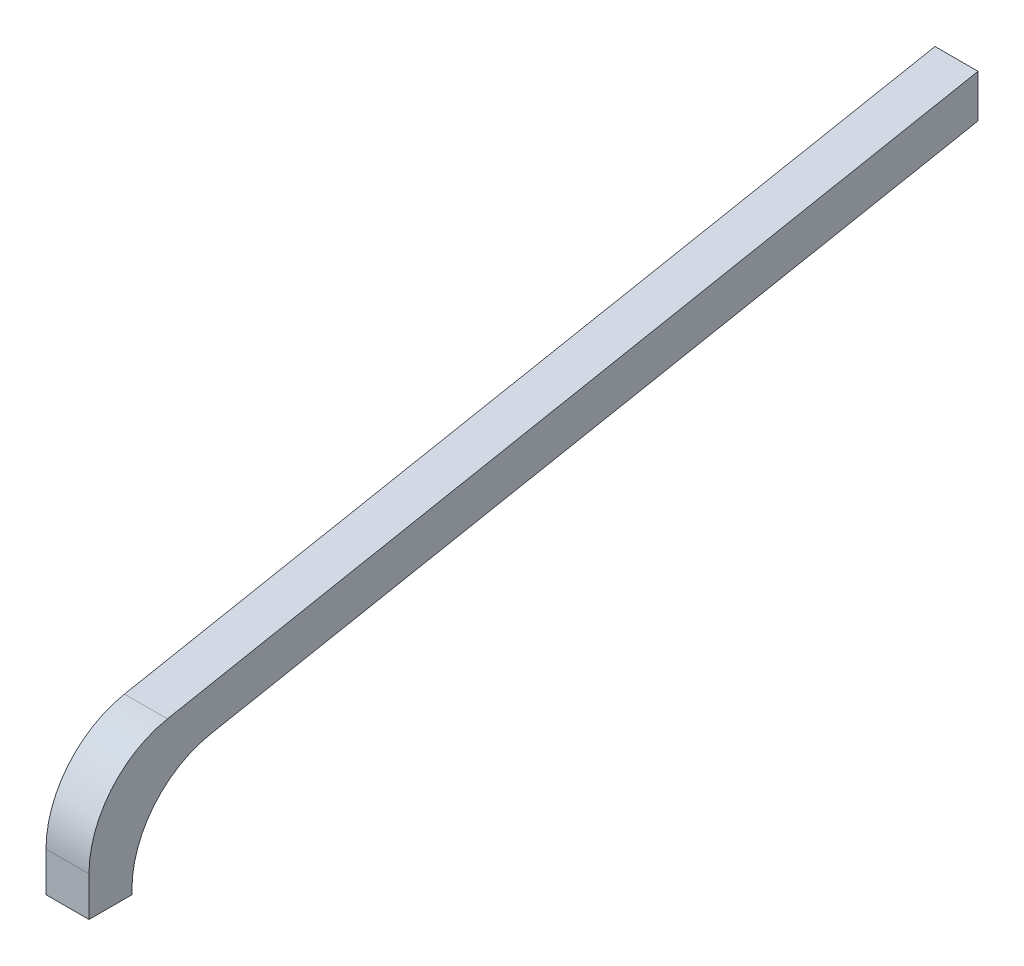
ISO-10303-21;
HEADER;
FILE_DESCRIPTION(('STEP AP214'),'2;1');
FILE_NAME('part.step','',(''),(''),'','','');
FILE_SCHEMA(('AUTOMOTIVE_DESIGN { 1 0 10303 214 1 1 1 1 }'));
ENDSEC;
DATA;
#1=APPLICATION_CONTEXT('core data for automotive mechanical design processes');
#2=APPLICATION_PROTOCOL_DEFINITION('international standard','automotive_design',2000,#1);
#3=PRODUCT_CONTEXT('',#1,'mechanical');
#4=PRODUCT('Part','Part','',(#3));
#5=PRODUCT_RELATED_PRODUCT_CATEGORY('part','',(#4));
#6=PRODUCT_DEFINITION_FORMATION('','',#4);
#7=PRODUCT_DEFINITION_CONTEXT('part definition',#1,'design');
#8=PRODUCT_DEFINITION('design','',#6,#7);
#9=PRODUCT_DEFINITION_SHAPE('','',#8);
#10=(LENGTH_UNIT() NAMED_UNIT(*) SI_UNIT(.MILLI.,.METRE.));
#11=(NAMED_UNIT(*) PLANE_ANGLE_UNIT() SI_UNIT($,.RADIAN.));
#12=(NAMED_UNIT(*) SI_UNIT($,.STERADIAN.) SOLID_ANGLE_UNIT());
#13=UNCERTAINTY_MEASURE_WITH_UNIT(LENGTH_MEASURE(1.E-05),#10,'distance_accuracy_value','');
#14=(GEOMETRIC_REPRESENTATION_CONTEXT(3) GLOBAL_UNCERTAINTY_ASSIGNED_CONTEXT((#13)) GLOBAL_UNIT_ASSIGNED_CONTEXT((#10,
#11,#12)) REPRESENTATION_CONTEXT('',''));
#15=CARTESIAN_POINT('',(0.,0.,0.));
#16=DIRECTION('',(0.,0.,1.));
#17=DIRECTION('',(1.,0.,0.));
#18=AXIS2_PLACEMENT_3D('',#15,#16,#17);
#19=CARTESIAN_POINT('',(-3.77825,-3.01580115473571,-2.8055));
#20=DIRECTION('',(1.,0.,0.));
#21=DIRECTION('',(0.,0.,-1.));
#22=AXIS2_PLACEMENT_3D('',#19,#20,#21);
#23=PLANE('',#22);
#24=DIRECTION('',(0.,-0.18846469104419,0.982079966311104));
#25=VECTOR('',#24,1.);
#26=CARTESIAN_POINT('',(-3.77825,-2.3929200336889,-3.06153530895581));
#27=LINE('',#26,#25);
#28=CARTESIAN_POINT('',(-3.77825,-0.869500000000001,-11.));
#29=VERTEX_POINT('',#28);
#30=CARTESIAN_POINT('',(-3.77825,-2.3929200336889,-3.06153530895581));
#31=VERTEX_POINT('',#30);
#32=EDGE_CURVE('E96',#29,#31,#27,.T.);
#33=ORIENTED_EDGE('',*,*,#32,.T.);
#34=CARTESIAN_POINT('',(-3.77825,-3.375,-3.25));
#35=DIRECTION('',(-1.,0.,0.));
#36=DIRECTION('',(0.,0.,1.));
#37=AXIS2_PLACEMENT_3D('',#34,#35,#36);
#38=CIRCLE('',#37,1.);
#39=CARTESIAN_POINT('',(-3.77825,-3.375,-2.25));
#40=VERTEX_POINT('',#39);
#41=EDGE_CURVE('E119',#31,#40,#38,.F.);
#42=ORIENTED_EDGE('',*,*,#41,.T.);
#43=DIRECTION('',(0.,1.,0.));
#44=VECTOR('',#43,1.);
#45=CARTESIAN_POINT('',(-3.77825,-3.425,-2.25));
#46=LINE('',#45,#44);
#47=CARTESIAN_POINT('',(-3.77825,-3.425,-2.25));
#48=VERTEX_POINT('',#47);
#49=EDGE_CURVE('E124',#40,#48,#46,.F.);
#50=ORIENTED_EDGE('',*,*,#49,.T.);
#51=DIRECTION('',(0.,0.,1.));
#52=VECTOR('',#51,1.);
#53=CARTESIAN_POINT('',(-3.77825,-3.425,-1.8055));
#54=LINE('',#53,#52);
#55=CARTESIAN_POINT('',(-3.77825,-3.425,-1.8055));
#56=VERTEX_POINT('',#55);
#57=EDGE_CURVE('E133',#48,#56,#54,.T.);
#58=ORIENTED_EDGE('',*,*,#57,.T.);
#59=DIRECTION('',(0.,1.,0.));
#60=VECTOR('',#59,1.);
#61=CARTESIAN_POINT('',(-3.77825,-3.01580115473571,-1.8055));
#62=LINE('',#61,#60);
#63=CARTESIAN_POINT('',(-3.77825,-3.01580115473571,-1.8055));
#64=VERTEX_POINT('',#63);
#65=EDGE_CURVE('E141',#56,#64,#62,.T.);
#66=ORIENTED_EDGE('',*,*,#65,.T.);
#67=CARTESIAN_POINT('',(-3.77825,-3.01580115473571,-2.8055));
#68=DIRECTION('',(-1.,0.,0.));
#69=DIRECTION('',(0.,0.,1.));
#70=AXIS2_PLACEMENT_3D('',#67,#68,#69);
#71=CIRCLE('',#70,1.);
#72=CARTESIAN_POINT('',(-3.77825,-2.03372118842461,-2.61703530895581));
#73=VERTEX_POINT('',#72);
#74=EDGE_CURVE('E20',#73,#64,#71,.F.);
#75=ORIENTED_EDGE('',*,*,#74,.F.);
#76=DIRECTION('',(0.,0.18846469104419,-0.982079966311104));
#77=VECTOR('',#76,1.);
#78=CARTESIAN_POINT('',(-3.77825,-0.425000000000001,-11.));
#79=LINE('',#78,#77);
#80=CARTESIAN_POINT('',(-3.77825,-0.425000000000001,-11.));
#81=VERTEX_POINT('',#80);
#82=EDGE_CURVE('E150',#73,#81,#79,.T.);
#83=ORIENTED_EDGE('',*,*,#82,.T.);
#84=DIRECTION('',(0.,1.,0.));
#85=VECTOR('',#84,1.);
#86=CARTESIAN_POINT('',(-3.77825,-0.869500000000001,-11.));
#87=LINE('',#86,#85);
#88=EDGE_CURVE('E70',#81,#29,#87,.F.);
#89=ORIENTED_EDGE('',*,*,#88,.T.);
#90=EDGE_LOOP('',(#33,#42,#50,#58,#66,#75,#83,#89));
#91=FACE_BOUND('',#90,.T.);
#92=ADVANCED_FACE('F17',(#91),#23,.F.);
#93=CARTESIAN_POINT('',(-3.33375,-0.869500000000001,-11.));
#94=DIRECTION('',(0.,0.,1.));
#95=DIRECTION('',(1.,0.,0.));
#96=AXIS2_PLACEMENT_3D('',#93,#94,#95);
#97=PLANE('',#96);
#98=DIRECTION('',(1.,0.,0.));
#99=VECTOR('',#98,1.);
#100=CARTESIAN_POINT('',(-3.33375,-0.425000000000001,-11.));
#101=LINE('',#100,#99);
#102=CARTESIAN_POINT('',(-3.33375,-0.425000000000001,-11.));
#103=VERTEX_POINT('',#102);
#104=EDGE_CURVE('E91',#81,#103,#101,.T.);
#105=ORIENTED_EDGE('',*,*,#104,.T.);
#106=DIRECTION('',(0.,1.,0.));
#107=VECTOR('',#106,1.);
#108=CARTESIAN_POINT('',(-3.33375,-3.01580115473571,-11.));
#109=LINE('',#108,#107);
#110=CARTESIAN_POINT('',(-3.33375,-0.869500000000001,-11.));
#111=VERTEX_POINT('',#110);
#112=EDGE_CURVE('E85',#111,#103,#109,.T.);
#113=ORIENTED_EDGE('',*,*,#112,.F.);
#114=DIRECTION('',(1.,0.,0.));
#115=VECTOR('',#114,1.);
#116=CARTESIAN_POINT('',(-3.33375,-0.869500000000001,-11.));
#117=LINE('',#116,#115);
#118=EDGE_CURVE('E88',#111,#29,#117,.F.);
#119=ORIENTED_EDGE('',*,*,#118,.T.);
#120=ORIENTED_EDGE('',*,*,#88,.F.);
#121=EDGE_LOOP('',(#105,#113,#119,#120));
#122=FACE_BOUND('',#121,.T.);
#123=ADVANCED_FACE('F87',(#122),#97,.F.);
#124=CARTESIAN_POINT('',(-3.33375,-0.425000000000001,-11.));
#125=DIRECTION('',(0.,-0.982079966311104,-0.18846469104419));
#126=DIRECTION('',(0.,0.18846469104419,-0.982079966311104));
#127=AXIS2_PLACEMENT_3D('',#124,#125,#126);
#128=PLANE('',#127);
#129=DIRECTION('',(-1.,0.,0.));
#130=VECTOR('',#129,1.);
#131=CARTESIAN_POINT('',(-3.33375,-2.03372118842461,-2.61703530895581));
#132=LINE('',#131,#130);
#133=CARTESIAN_POINT('',(-3.33375,-2.03372118842461,-2.61703530895581));
#134=VERTEX_POINT('',#133);
#135=EDGE_CURVE('E146',#134,#73,#132,.T.);
#136=ORIENTED_EDGE('',*,*,#135,.F.);
#137=DIRECTION('',(0.,-0.18846469104419,0.982079966311103));
#138=VECTOR('',#137,1.);
#139=CARTESIAN_POINT('',(-3.33375,-0.425000000000001,-11.));
#140=LINE('',#139,#138);
#141=EDGE_CURVE('E95',#103,#134,#140,.T.);
#142=ORIENTED_EDGE('',*,*,#141,.F.);
#143=ORIENTED_EDGE('',*,*,#104,.F.);
#144=ORIENTED_EDGE('',*,*,#82,.F.);
#145=EDGE_LOOP('',(#136,#142,#143,#144));
#146=FACE_BOUND('',#145,.T.);
#147=ADVANCED_FACE('F190',(#146),#128,.F.);
#148=CARTESIAN_POINT('',(-3.33375,-3.01580115473571,-2.8055));
#149=DIRECTION('',(-1.,0.,0.));
#150=DIRECTION('',(0.,0.,1.));
#151=AXIS2_PLACEMENT_3D('',#148,#149,#150);
#152=CYLINDRICAL_SURFACE('',#151,1.);
#153=CARTESIAN_POINT('',(-3.33375,-3.01580115473571,-2.8055));
#154=DIRECTION('',(-1.,0.,0.));
#155=DIRECTION('',(0.,0.,1.));
#156=AXIS2_PLACEMENT_3D('',#153,#154,#155);
#157=CIRCLE('',#156,1.);
#158=CARTESIAN_POINT('',(-3.33375,-3.01580115473571,-1.8055));
#159=VERTEX_POINT('',#158);
#160=EDGE_CURVE('E116',#134,#159,#157,.F.);
#161=ORIENTED_EDGE('',*,*,#160,.F.);
#162=ORIENTED_EDGE('',*,*,#135,.T.);
#163=ORIENTED_EDGE('',*,*,#74,.T.);
#164=DIRECTION('',(-1.,0.,0.));
#165=VECTOR('',#164,1.);
#166=CARTESIAN_POINT('',(-3.33375,-3.01580115473571,-1.8055));
#167=LINE('',#166,#165);
#168=EDGE_CURVE('E144',#64,#159,#167,.F.);
#169=ORIENTED_EDGE('',*,*,#168,.T.);
#170=EDGE_LOOP('',(#161,#162,#163,#169));
#171=FACE_BOUND('',#170,.T.);
#172=ADVANCED_FACE('F169',(#171),#152,.T.);
#173=CARTESIAN_POINT('',(-3.33375,-3.01580115473571,-1.8055));
#174=DIRECTION('',(0.,0.,-1.));
#175=DIRECTION('',(-1.,0.,0.));
#176=AXIS2_PLACEMENT_3D('',#173,#174,#175);
#177=PLANE('',#176);
#178=DIRECTION('',(1.,0.,0.));
#179=VECTOR('',#178,1.);
#180=CARTESIAN_POINT('',(-3.33375,-3.425,-1.8055));
#181=LINE('',#180,#179);
#182=CARTESIAN_POINT('',(-3.33375,-3.425,-1.8055));
#183=VERTEX_POINT('',#182);
#184=EDGE_CURVE('E139',#56,#183,#181,.T.);
#185=ORIENTED_EDGE('',*,*,#184,.T.);
#186=DIRECTION('',(0.,1.,0.));
#187=VECTOR('',#186,1.);
#188=CARTESIAN_POINT('',(-3.33375,-3.01580115473571,-1.8055));
#189=LINE('',#188,#187);
#190=EDGE_CURVE('E118',#159,#183,#189,.F.);
#191=ORIENTED_EDGE('',*,*,#190,.F.);
#192=ORIENTED_EDGE('',*,*,#168,.F.);
#193=ORIENTED_EDGE('',*,*,#65,.F.);
#194=EDGE_LOOP('',(#185,#191,#192,#193));
#195=FACE_BOUND('',#194,.T.);
#196=ADVANCED_FACE('F174',(#195),#177,.F.);
#197=CARTESIAN_POINT('',(-3.33375,-3.425,-1.8055));
#198=DIRECTION('',(0.,1.,0.));
#199=DIRECTION('',(0.,0.,1.));
#200=AXIS2_PLACEMENT_3D('',#197,#198,#199);
#201=PLANE('',#200);
#202=DIRECTION('',(1.,0.,0.));
#203=VECTOR('',#202,1.);
#204=CARTESIAN_POINT('',(-3.33375,-3.425,-2.25));
#205=LINE('',#204,#203);
#206=CARTESIAN_POINT('',(-3.33375,-3.425,-2.25));
#207=VERTEX_POINT('',#206);
#208=EDGE_CURVE('E127',#48,#207,#205,.T.);
#209=ORIENTED_EDGE('',*,*,#208,.T.);
#210=DIRECTION('',(0.,0.,-1.));
#211=VECTOR('',#210,1.);
#212=CARTESIAN_POINT('',(-3.33375,-3.425,-2.8055));
#213=LINE('',#212,#211);
#214=EDGE_CURVE('E110',#183,#207,#213,.T.);
#215=ORIENTED_EDGE('',*,*,#214,.F.);
#216=ORIENTED_EDGE('',*,*,#184,.F.);
#217=ORIENTED_EDGE('',*,*,#57,.F.);
#218=EDGE_LOOP('',(#209,#215,#216,#217));
#219=FACE_BOUND('',#218,.T.);
#220=ADVANCED_FACE('F212',(#219),#201,.F.);
#221=CARTESIAN_POINT('',(-3.33375,-3.425,-2.25));
#222=DIRECTION('',(0.,0.,1.));
#223=DIRECTION('',(1.,0.,0.));
#224=AXIS2_PLACEMENT_3D('',#221,#222,#223);
#225=PLANE('',#224);
#226=DIRECTION('',(-1.,0.,0.));
#227=VECTOR('',#226,1.);
#228=CARTESIAN_POINT('',(-3.33375,-3.375,-2.25));
#229=LINE('',#228,#227);
#230=CARTESIAN_POINT('',(-3.33375,-3.375,-2.25));
#231=VERTEX_POINT('',#230);
#232=EDGE_CURVE('E121',#40,#231,#229,.F.);
#233=ORIENTED_EDGE('',*,*,#232,.T.);
#234=DIRECTION('',(0.,1.,0.));
#235=VECTOR('',#234,1.);
#236=CARTESIAN_POINT('',(-3.33375,-3.01580115473571,-2.25));
#237=LINE('',#236,#235);
#238=EDGE_CURVE('E107',#207,#231,#237,.T.);
#239=ORIENTED_EDGE('',*,*,#238,.F.);
#240=ORIENTED_EDGE('',*,*,#208,.F.);
#241=ORIENTED_EDGE('',*,*,#49,.F.);
#242=EDGE_LOOP('',(#233,#239,#240,#241));
#243=FACE_BOUND('',#242,.T.);
#244=ADVANCED_FACE('F209',(#243),#225,.F.);
#245=CARTESIAN_POINT('',(-3.33375,-3.375,-3.25));
#246=DIRECTION('',(-1.,0.,0.));
#247=DIRECTION('',(0.,0.,1.));
#248=AXIS2_PLACEMENT_3D('',#245,#246,#247);
#249=CYLINDRICAL_SURFACE('',#248,1.);
#250=DIRECTION('',(1.,0.,0.));
#251=VECTOR('',#250,1.);
#252=CARTESIAN_POINT('',(-3.33375,-2.3929200336889,-3.06153530895581));
#253=LINE('',#252,#251);
#254=CARTESIAN_POINT('',(-3.33375,-2.3929200336889,-3.06153530895581));
#255=VERTEX_POINT('',#254);
#256=EDGE_CURVE('E35',#31,#255,#253,.T.);
#257=ORIENTED_EDGE('',*,*,#256,.T.);
#258=CARTESIAN_POINT('',(-3.33375,-3.375,-3.25));
#259=DIRECTION('',(-1.,0.,0.));
#260=DIRECTION('',(0.,0.,1.));
#261=AXIS2_PLACEMENT_3D('',#258,#259,#260);
#262=CIRCLE('',#261,1.);
#263=EDGE_CURVE('E26',#231,#255,#262,.T.);
#264=ORIENTED_EDGE('',*,*,#263,.F.);
#265=ORIENTED_EDGE('',*,*,#232,.F.);
#266=ORIENTED_EDGE('',*,*,#41,.F.);
#267=EDGE_LOOP('',(#257,#264,#265,#266));
#268=FACE_BOUND('',#267,.T.);
#269=ADVANCED_FACE('F204',(#268),#249,.F.);
#270=CARTESIAN_POINT('',(-3.33375,-2.3929200336889,-3.06153530895581));
#271=DIRECTION('',(0.,0.982079966311104,0.18846469104419));
#272=DIRECTION('',(0.,-0.18846469104419,0.982079966311104));
#273=AXIS2_PLACEMENT_3D('',#270,#271,#272);
#274=PLANE('',#273);
#275=ORIENTED_EDGE('',*,*,#118,.F.);
#276=DIRECTION('',(0.,0.18846469104419,-0.982079966311103));
#277=VECTOR('',#276,1.);
#278=CARTESIAN_POINT('',(-3.33375,-2.3929200336889,-3.06153530895581));
#279=LINE('',#278,#277);
#280=EDGE_CURVE('E11',#255,#111,#279,.T.);
#281=ORIENTED_EDGE('',*,*,#280,.F.);
#282=ORIENTED_EDGE('',*,*,#256,.F.);
#283=ORIENTED_EDGE('',*,*,#32,.F.);
#284=EDGE_LOOP('',(#275,#281,#282,#283));
#285=FACE_BOUND('',#284,.T.);
#286=ADVANCED_FACE('F99',(#285),#274,.F.);
#287=CARTESIAN_POINT('',(-3.33375,-3.01580115473571,-2.8055));
#288=DIRECTION('',(1.,0.,0.));
#289=DIRECTION('',(0.,0.,-1.));
#290=AXIS2_PLACEMENT_3D('',#287,#288,#289);
#291=PLANE('',#290);
#292=ORIENTED_EDGE('',*,*,#263,.T.);
#293=ORIENTED_EDGE('',*,*,#280,.T.);
#294=ORIENTED_EDGE('',*,*,#112,.T.);
#295=ORIENTED_EDGE('',*,*,#141,.T.);
#296=ORIENTED_EDGE('',*,*,#160,.T.);
#297=ORIENTED_EDGE('',*,*,#190,.T.);
#298=ORIENTED_EDGE('',*,*,#214,.T.);
#299=ORIENTED_EDGE('',*,*,#238,.T.);
#300=EDGE_LOOP('',(#292,#293,#294,#295,#296,#297,#298,#299));
#301=FACE_BOUND('',#300,.T.);
#302=ADVANCED_FACE('F103',(#301),#291,.T.);
#303=CLOSED_SHELL('',(#92,#123,#147,#172,#196,#220,#244,#269,#286,#302));
#304=MANIFOLD_SOLID_BREP('B1',#303);
#305=ADVANCED_BREP_SHAPE_REPRESENTATION('',(#18,#304),#14);
#306=SHAPE_DEFINITION_REPRESENTATION(#9,#305);
ENDSEC;
END-ISO-10303-21;
